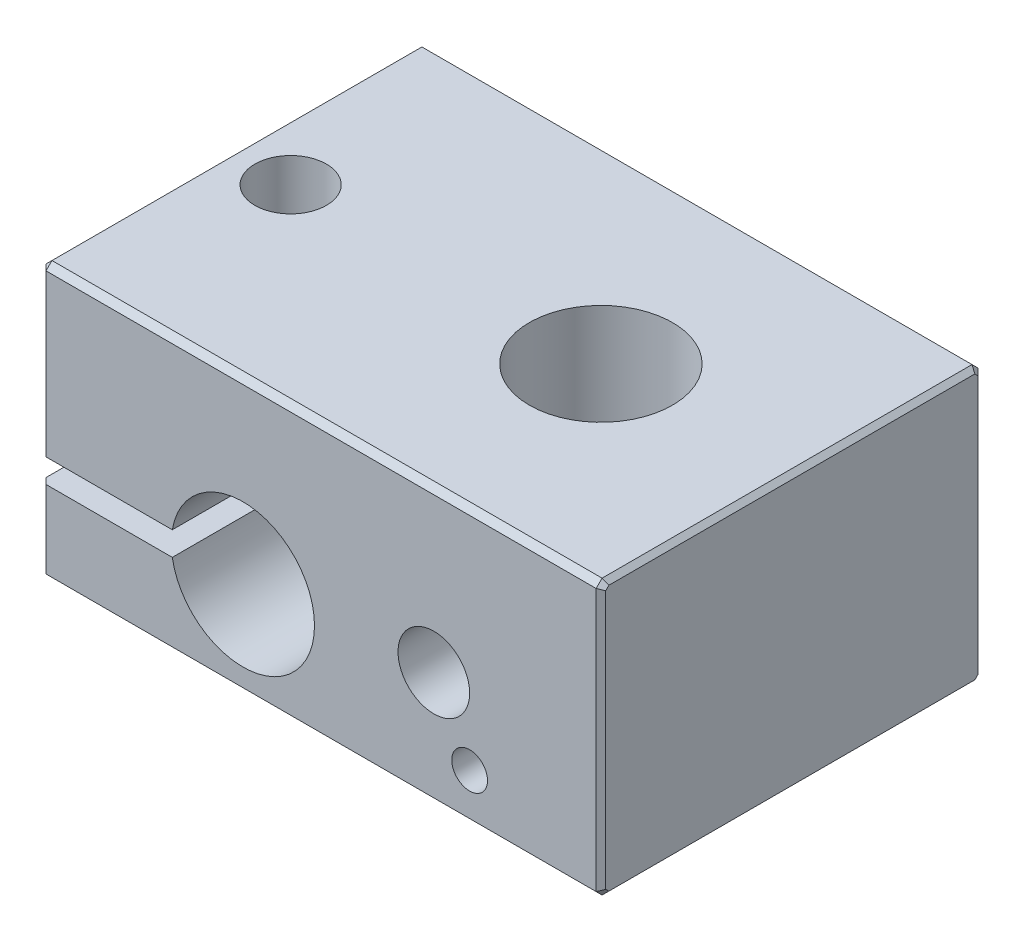
ISO-10303-21;
HEADER;
FILE_DESCRIPTION(('STEP AP214'),'2;1');
FILE_NAME('part.step','',(''),(''),'','','');
FILE_SCHEMA(('AUTOMOTIVE_DESIGN { 1 0 10303 214 1 1 1 1 }'));
ENDSEC;
DATA;
#1=APPLICATION_CONTEXT('core data for automotive mechanical design processes');
#2=APPLICATION_PROTOCOL_DEFINITION('international standard','automotive_design',2000,#1);
#3=PRODUCT_CONTEXT('',#1,'mechanical');
#4=PRODUCT('Part','Part','',(#3));
#5=PRODUCT_RELATED_PRODUCT_CATEGORY('part','',(#4));
#6=PRODUCT_DEFINITION_FORMATION('','',#4);
#7=PRODUCT_DEFINITION_CONTEXT('part definition',#1,'design');
#8=PRODUCT_DEFINITION('design','',#6,#7);
#9=PRODUCT_DEFINITION_SHAPE('','',#8);
#10=(LENGTH_UNIT() NAMED_UNIT(*) SI_UNIT(.MILLI.,.METRE.));
#11=(NAMED_UNIT(*) PLANE_ANGLE_UNIT() SI_UNIT($,.RADIAN.));
#12=(NAMED_UNIT(*) SI_UNIT($,.STERADIAN.) SOLID_ANGLE_UNIT());
#13=UNCERTAINTY_MEASURE_WITH_UNIT(LENGTH_MEASURE(1.E-05),#10,'distance_accuracy_value','');
#14=(GEOMETRIC_REPRESENTATION_CONTEXT(3) GLOBAL_UNCERTAINTY_ASSIGNED_CONTEXT((#13)) GLOBAL_UNIT_ASSIGNED_CONTEXT((#10,
#11,#12)) REPRESENTATION_CONTEXT('',''));
#15=CARTESIAN_POINT('',(0.,0.,0.));
#16=DIRECTION('',(0.,0.,1.));
#17=DIRECTION('',(1.,0.,0.));
#18=AXIS2_PLACEMENT_3D('',#15,#16,#17);
#19=CARTESIAN_POINT('',(8.00000000000001,2.,3.49999999999999));
#20=DIRECTION('',(0.,0.,1.));
#21=DIRECTION('',(1.,0.,0.));
#22=AXIS2_PLACEMENT_3D('',#19,#20,#21);
#23=PLANE('',#22);
#24=CARTESIAN_POINT('',(8.00000000000001,2.,3.49999999999999));
#25=DIRECTION('',(0.,0.,1.));
#26=DIRECTION('',(1.,0.,0.));
#27=AXIS2_PLACEMENT_3D('',#24,#25,#26);
#28=CIRCLE('',#27,0.750000000000001);
#29=CARTESIAN_POINT('',(8.75000000000001,2.,3.49999999999999));
#30=VERTEX_POINT('',#29);
#31=EDGE_CURVE('E395',#30,#30,#28,.T.);
#32=ORIENTED_EDGE('',*,*,#31,.T.);
#33=EDGE_LOOP('',(#32));
#34=FACE_BOUND('',#33,.T.);
#35=ADVANCED_FACE('F34',(#34),#23,.T.);
#36=CARTESIAN_POINT('',(6.50000000000001,4.8,4.49999999999999));
#37=DIRECTION('',(0.,0.,1.));
#38=DIRECTION('',(1.,0.,0.));
#39=AXIS2_PLACEMENT_3D('',#36,#37,#38);
#40=PLANE('',#39);
#41=CARTESIAN_POINT('',(6.50000000000001,4.8,4.49999999999999));
#42=DIRECTION('',(0.,0.,1.));
#43=DIRECTION('',(1.,0.,0.));
#44=AXIS2_PLACEMENT_3D('',#41,#42,#43);
#45=CIRCLE('',#44,1.5);
#46=CARTESIAN_POINT('',(8.00000000000001,4.8,4.49999999999999));
#47=VERTEX_POINT('',#46);
#48=EDGE_CURVE('E267',#47,#47,#45,.T.);
#49=ORIENTED_EDGE('',*,*,#48,.T.);
#50=EDGE_LOOP('',(#49));
#51=FACE_BOUND('',#50,.T.);
#52=ADVANCED_FACE('F637',(#51),#40,.T.);
#53=CARTESIAN_POINT('',(-10.,11.5,-8.00000000000001));
#54=DIRECTION('',(1.,0.,0.));
#55=DIRECTION('',(0.,0.,-1.));
#56=AXIS2_PLACEMENT_3D('',#53,#54,#55);
#57=PLANE('',#56);
#58=DIRECTION('',(0.,1.,0.));
#59=VECTOR('',#58,1.);
#60=CARTESIAN_POINT('',(-9.99999999999999,11.5,7.74999999999999));
#61=LINE('',#60,#59);
#62=CARTESIAN_POINT('',(-9.99999999999999,0.249999999999997,7.74999999999999));
#63=VERTEX_POINT('',#62);
#64=CARTESIAN_POINT('',(-9.99999999999999,3.5,7.74999999999999));
#65=VERTEX_POINT('',#64);
#66=EDGE_CURVE('E393',#63,#65,#61,.T.);
#67=ORIENTED_EDGE('',*,*,#66,.T.);
#68=DIRECTION('',(0.,0.,1.));
#69=VECTOR('',#68,1.);
#70=CARTESIAN_POINT('',(-9.99999999999999,3.5,-8.00000000000001));
#71=LINE('',#70,#69);
#72=CARTESIAN_POINT('',(-9.99999999999999,3.5,-7.75000000000001));
#73=VERTEX_POINT('',#72);
#74=EDGE_CURVE('E373',#65,#73,#71,.F.);
#75=ORIENTED_EDGE('',*,*,#74,.T.);
#76=DIRECTION('',(0.,1.,0.));
#77=VECTOR('',#76,1.);
#78=CARTESIAN_POINT('',(-9.99999999999999,11.5,-7.75000000000001));
#79=LINE('',#78,#77);
#80=CARTESIAN_POINT('',(-9.99999999999999,0.249999999999997,-7.75000000000001));
#81=VERTEX_POINT('',#80);
#82=EDGE_CURVE('E375',#73,#81,#79,.F.);
#83=ORIENTED_EDGE('',*,*,#82,.T.);
#84=DIRECTION('',(0.,0.,1.));
#85=VECTOR('',#84,1.);
#86=CARTESIAN_POINT('',(-10.,0.249999999999997,-8.00000000000001));
#87=LINE('',#86,#85);
#88=EDGE_CURVE('E324',#81,#63,#87,.T.);
#89=ORIENTED_EDGE('',*,*,#88,.T.);
#90=EDGE_LOOP('',(#67,#75,#83,#89));
#91=FACE_BOUND('',#90,.T.);
#92=ADVANCED_FACE('F634',(#91),#57,.F.);
#93=CARTESIAN_POINT('',(-9.75,0.249999999999997,7.99999999999999));
#94=DIRECTION('',(-0.577350269189623,-0.577350269189639,0.577350269189615));
#95=DIRECTION('',(0.707106781186557,-0.707106781186538,0.));
#96=AXIS2_PLACEMENT_3D('',#93,#94,#95);
#97=PLANE('',#96);
#98=DIRECTION('',(-0.707106781186556,0.707106781186539,0.));
#99=VECTOR('',#98,1.);
#100=CARTESIAN_POINT('',(-10.,0.249999999999998,7.74999999999999));
#101=LINE('',#100,#99);
#102=CARTESIAN_POINT('',(-9.74999999999999,0.,7.74999999999999));
#103=VERTEX_POINT('',#102);
#104=EDGE_CURVE('E340',#63,#103,#101,.F.);
#105=ORIENTED_EDGE('',*,*,#104,.T.);
#106=DIRECTION('',(0.,0.707106781186543,0.707106781186552));
#107=VECTOR('',#106,1.);
#108=CARTESIAN_POINT('',(-9.74999999999999,0.249999999999997,7.99999999999999));
#109=LINE('',#108,#107);
#110=CARTESIAN_POINT('',(-9.75,0.249999999999997,7.99999999999999));
#111=VERTEX_POINT('',#110);
#112=EDGE_CURVE('E311',#103,#111,#109,.T.);
#113=ORIENTED_EDGE('',*,*,#112,.T.);
#114=DIRECTION('',(-0.707106781186543,0.,-0.707106781186552));
#115=VECTOR('',#114,1.);
#116=CARTESIAN_POINT('',(-9.75,0.249999999999997,7.99999999999999));
#117=LINE('',#116,#115);
#118=EDGE_CURVE('E396',#111,#63,#117,.T.);
#119=ORIENTED_EDGE('',*,*,#118,.T.);
#120=EDGE_LOOP('',(#105,#113,#119));
#121=FACE_BOUND('',#120,.T.);
#122=ADVANCED_FACE('F631',(#121),#97,.T.);
#123=CARTESIAN_POINT('',(-10.,0.249999999999997,-7.75000000000001));
#124=DIRECTION('',(-0.577350269189615,-0.577350269189639,-0.577350269189623));
#125=DIRECTION('',(0.,0.707106781186537,-0.707106781186557));
#126=AXIS2_PLACEMENT_3D('',#123,#124,#125);
#127=PLANE('',#126);
#128=DIRECTION('',(0.707106781186552,0.,-0.707106781186543));
#129=VECTOR('',#128,1.);
#130=CARTESIAN_POINT('',(-10.,0.249999999999997,-7.75000000000001));
#131=LINE('',#130,#129);
#132=CARTESIAN_POINT('',(-9.75,0.249999999999997,-8.00000000000001));
#133=VERTEX_POINT('',#132);
#134=EDGE_CURVE('E272',#81,#133,#131,.T.);
#135=ORIENTED_EDGE('',*,*,#134,.T.);
#136=DIRECTION('',(0.,-0.707106781186543,0.707106781186552));
#137=VECTOR('',#136,1.);
#138=CARTESIAN_POINT('',(-9.75,0.249999999999997,-8.00000000000001));
#139=LINE('',#138,#137);
#140=CARTESIAN_POINT('',(-9.74999999999999,0.,-7.75000000000001));
#141=VERTEX_POINT('',#140);
#142=EDGE_CURVE('E314',#133,#141,#139,.T.);
#143=ORIENTED_EDGE('',*,*,#142,.T.);
#144=DIRECTION('',(-0.707106781186556,0.707106781186539,0.));
#145=VECTOR('',#144,1.);
#146=CARTESIAN_POINT('',(-10.,0.249999999999997,-7.75000000000001));
#147=LINE('',#146,#145);
#148=EDGE_CURVE('E315',#141,#81,#147,.T.);
#149=ORIENTED_EDGE('',*,*,#148,.T.);
#150=EDGE_LOOP('',(#135,#143,#149));
#151=FACE_BOUND('',#150,.T.);
#152=ADVANCED_FACE('F519',(#151),#127,.T.);
#153=CARTESIAN_POINT('',(-9.75,11.5,7.99999999999999));
#154=DIRECTION('',(0.707106781186552,0.,-0.707106781186543));
#155=DIRECTION('',(-0.707106781186543,0.,-0.707106781186552));
#156=AXIS2_PLACEMENT_3D('',#153,#154,#155);
#157=PLANE('',#156);
#158=ORIENTED_EDGE('',*,*,#66,.F.);
#159=ORIENTED_EDGE('',*,*,#118,.F.);
#160=DIRECTION('',(0.,1.,0.));
#161=VECTOR('',#160,1.);
#162=CARTESIAN_POINT('',(-9.75,11.5,7.99999999999999));
#163=LINE('',#162,#161);
#164=CARTESIAN_POINT('',(-9.75,3.5,7.99999999999999));
#165=VERTEX_POINT('',#164);
#166=EDGE_CURVE('E232',#111,#165,#163,.T.);
#167=ORIENTED_EDGE('',*,*,#166,.T.);
#168=DIRECTION('',(-0.707106781186538,0.,-0.707106781186557));
#169=VECTOR('',#168,1.);
#170=CARTESIAN_POINT('',(-9.75,3.5,7.99999999999999));
#171=LINE('',#170,#169);
#172=EDGE_CURVE('E266',#165,#65,#171,.T.);
#173=ORIENTED_EDGE('',*,*,#172,.T.);
#174=EDGE_LOOP('',(#158,#159,#167,#173));
#175=FACE_BOUND('',#174,.T.);
#176=ADVANCED_FACE('F489',(#175),#157,.F.);
#177=CARTESIAN_POINT('',(8.00000000000001,2.,3.49999999999999));
#178=DIRECTION('',(0.,0.,1.));
#179=DIRECTION('',(1.,0.,0.));
#180=AXIS2_PLACEMENT_3D('',#177,#178,#179);
#181=CYLINDRICAL_SURFACE('',#180,0.750000000000001);
#182=ORIENTED_EDGE('',*,*,#31,.F.);
#183=EDGE_LOOP('',(#182));
#184=FACE_BOUND('',#183,.T.);
#185=CARTESIAN_POINT('',(8.00000000000001,2.,7.99999999999999));
#186=DIRECTION('',(0.,0.,1.));
#187=DIRECTION('',(1.,0.,0.));
#188=AXIS2_PLACEMENT_3D('',#185,#186,#187);
#189=CIRCLE('',#188,0.750000000000001);
#190=CARTESIAN_POINT('',(8.75000000000001,2.,7.99999999999999));
#191=VERTEX_POINT('',#190);
#192=EDGE_CURVE('E231',#191,#191,#189,.T.);
#193=ORIENTED_EDGE('',*,*,#192,.T.);
#194=EDGE_LOOP('',(#193));
#195=FACE_BOUND('',#194,.T.);
#196=ADVANCED_FACE('F622',(#184,#195),#181,.F.);
#197=CARTESIAN_POINT('',(6.50000000000001,4.8,4.49999999999999));
#198=DIRECTION('',(0.,0.,1.));
#199=DIRECTION('',(1.,0.,0.));
#200=AXIS2_PLACEMENT_3D('',#197,#198,#199);
#201=CYLINDRICAL_SURFACE('',#200,1.5);
#202=ORIENTED_EDGE('',*,*,#48,.F.);
#203=EDGE_LOOP('',(#202));
#204=FACE_BOUND('',#203,.T.);
#205=CARTESIAN_POINT('',(6.50000000000001,4.8,7.99999999999999));
#206=DIRECTION('',(0.,0.,1.));
#207=DIRECTION('',(1.,0.,0.));
#208=AXIS2_PLACEMENT_3D('',#205,#206,#207);
#209=CIRCLE('',#208,1.5);
#210=CARTESIAN_POINT('',(8.00000000000001,4.8,7.99999999999999));
#211=VERTEX_POINT('',#210);
#212=EDGE_CURVE('E260',#211,#211,#209,.T.);
#213=ORIENTED_EDGE('',*,*,#212,.T.);
#214=EDGE_LOOP('',(#213));
#215=FACE_BOUND('',#214,.T.);
#216=ADVANCED_FACE('F619',(#204,#215),#201,.F.);
#217=CARTESIAN_POINT('',(-9.99999999999999,3.5,-8.00000000000001));
#218=DIRECTION('',(0.,-1.,0.));
#219=DIRECTION('',(1.,0.,0.));
#220=AXIS2_PLACEMENT_3D('',#217,#218,#219);
#221=PLANE('',#220);
#222=ORIENTED_EDGE('',*,*,#172,.F.);
#223=DIRECTION('',(-1.,0.,0.));
#224=VECTOR('',#223,1.);
#225=CARTESIAN_POINT('',(-9.99999999999999,3.5,7.99999999999999));
#226=LINE('',#225,#224);
#227=CARTESIAN_POINT('',(-4.4580398915498,3.5,7.99999999999999));
#228=VERTEX_POINT('',#227);
#229=EDGE_CURVE('E228',#165,#228,#226,.F.);
#230=ORIENTED_EDGE('',*,*,#229,.T.);
#231=DIRECTION('',(0.,0.,1.));
#232=VECTOR('',#231,1.);
#233=CARTESIAN_POINT('',(-4.4580398915498,3.5,-8.00000000000001));
#234=LINE('',#233,#232);
#235=CARTESIAN_POINT('',(-4.4580398915498,3.5,-8.00000000000001));
#236=VERTEX_POINT('',#235);
#237=EDGE_CURVE('E263',#236,#228,#234,.T.);
#238=ORIENTED_EDGE('',*,*,#237,.F.);
#239=DIRECTION('',(1.,0.,0.));
#240=VECTOR('',#239,1.);
#241=CARTESIAN_POINT('',(-10.,3.5,-8.00000000000001));
#242=LINE('',#241,#240);
#243=CARTESIAN_POINT('',(-9.75,3.5,-8.00000000000001));
#244=VERTEX_POINT('',#243);
#245=EDGE_CURVE('E222',#236,#244,#242,.F.);
#246=ORIENTED_EDGE('',*,*,#245,.T.);
#247=DIRECTION('',(0.707106781186552,0.,-0.707106781186543));
#248=VECTOR('',#247,1.);
#249=CARTESIAN_POINT('',(-10.,3.5,-7.75000000000001));
#250=LINE('',#249,#248);
#251=EDGE_CURVE('E268',#244,#73,#250,.F.);
#252=ORIENTED_EDGE('',*,*,#251,.T.);
#253=ORIENTED_EDGE('',*,*,#74,.F.);
#254=EDGE_LOOP('',(#222,#230,#238,#246,#252,#253));
#255=FACE_BOUND('',#254,.T.);
#256=CARTESIAN_POINT('',(-7.49999999999999,3.5,0.));
#257=DIRECTION('',(0.,1.,0.));
#258=DIRECTION('',(0.,0.,1.));
#259=AXIS2_PLACEMENT_3D('',#256,#257,#258);
#260=CIRCLE('',#259,1.5);
#261=CARTESIAN_POINT('',(-7.49999999999999,3.5,1.49999999999999));
#262=VERTEX_POINT('',#261);
#263=EDGE_CURVE('E386',#262,#262,#260,.F.);
#264=ORIENTED_EDGE('',*,*,#263,.T.);
#265=EDGE_LOOP('',(#264));
#266=FACE_BOUND('',#265,.T.);
#267=ADVANCED_FACE('F494',(#255,#266),#221,.F.);
#268=CARTESIAN_POINT('',(-10.,11.5,-7.75000000000001));
#269=DIRECTION('',(0.707106781186543,0.,0.707106781186552));
#270=DIRECTION('',(0.707106781186552,0.,-0.707106781186543));
#271=AXIS2_PLACEMENT_3D('',#268,#269,#270);
#272=PLANE('',#271);
#273=DIRECTION('',(0.,1.,0.));
#274=VECTOR('',#273,1.);
#275=CARTESIAN_POINT('',(-9.75,11.5,-8.00000000000001));
#276=LINE('',#275,#274);
#277=EDGE_CURVE('E224',#244,#133,#276,.F.);
#278=ORIENTED_EDGE('',*,*,#277,.T.);
#279=ORIENTED_EDGE('',*,*,#134,.F.);
#280=ORIENTED_EDGE('',*,*,#82,.F.);
#281=ORIENTED_EDGE('',*,*,#251,.F.);
#282=EDGE_LOOP('',(#278,#279,#280,#281));
#283=FACE_BOUND('',#282,.T.);
#284=ADVANCED_FACE('F512',(#283),#272,.F.);
#285=CARTESIAN_POINT('',(-10.,11.5,-7.75000000000001));
#286=DIRECTION('',(0.707106781186552,0.,0.707106781186543));
#287=DIRECTION('',(0.707106781186543,0.,-0.707106781186552));
#288=AXIS2_PLACEMENT_3D('',#285,#286,#287);
#289=PLANE('',#288);
#290=DIRECTION('',(0.,1.,0.));
#291=VECTOR('',#290,1.);
#292=CARTESIAN_POINT('',(-10.,11.5,-7.75000000000001));
#293=LINE('',#292,#291);
#294=CARTESIAN_POINT('',(-9.99999999999999,4.5,-7.75000000000001));
#295=VERTEX_POINT('',#294);
#296=CARTESIAN_POINT('',(-10.,11.25,-7.75000000000001));
#297=VERTEX_POINT('',#296);
#298=EDGE_CURVE('E285',#295,#297,#293,.T.);
#299=ORIENTED_EDGE('',*,*,#298,.T.);
#300=DIRECTION('',(-0.707106781186542,0.,0.707106781186552));
#301=VECTOR('',#300,1.);
#302=CARTESIAN_POINT('',(-9.75,11.25,-8.00000000000001));
#303=LINE('',#302,#301);
#304=CARTESIAN_POINT('',(-9.75,11.25,-8.00000000000001));
#305=VERTEX_POINT('',#304);
#306=EDGE_CURVE('E195',#305,#297,#303,.T.);
#307=ORIENTED_EDGE('',*,*,#306,.F.);
#308=DIRECTION('',(0.,1.,0.));
#309=VECTOR('',#308,1.);
#310=CARTESIAN_POINT('',(-9.75,11.5,-8.00000000000001));
#311=LINE('',#310,#309);
#312=CARTESIAN_POINT('',(-9.75,4.5,-8.00000000000001));
#313=VERTEX_POINT('',#312);
#314=EDGE_CURVE('E257',#305,#313,#311,.F.);
#315=ORIENTED_EDGE('',*,*,#314,.T.);
#316=DIRECTION('',(0.707106781186543,0.,-0.707106781186552));
#317=VECTOR('',#316,1.);
#318=CARTESIAN_POINT('',(-10.,4.5,-7.75000000000001));
#319=LINE('',#318,#317);
#320=EDGE_CURVE('E271',#295,#313,#319,.T.);
#321=ORIENTED_EDGE('',*,*,#320,.F.);
#322=EDGE_LOOP('',(#299,#307,#315,#321));
#323=FACE_BOUND('',#322,.T.);
#324=ADVANCED_FACE('F610',(#323),#289,.F.);
#325=CARTESIAN_POINT('',(-9.75,11.5,7.99999999999999));
#326=DIRECTION('',(0.707106781186552,0.,-0.707106781186543));
#327=DIRECTION('',(-0.707106781186543,0.,-0.707106781186552));
#328=AXIS2_PLACEMENT_3D('',#325,#326,#327);
#329=PLANE('',#328);
#330=DIRECTION('',(0.,1.,0.));
#331=VECTOR('',#330,1.);
#332=CARTESIAN_POINT('',(-9.75,11.5,7.99999999999999));
#333=LINE('',#332,#331);
#334=CARTESIAN_POINT('',(-9.75,4.5,7.99999999999999));
#335=VERTEX_POINT('',#334);
#336=CARTESIAN_POINT('',(-9.75,11.25,7.99999999999999));
#337=VERTEX_POINT('',#336);
#338=EDGE_CURVE('E246',#335,#337,#333,.T.);
#339=ORIENTED_EDGE('',*,*,#338,.T.);
#340=DIRECTION('',(-0.707106781186543,0.,-0.707106781186552));
#341=VECTOR('',#340,1.);
#342=CARTESIAN_POINT('',(-9.75,11.25,7.99999999999999));
#343=LINE('',#342,#341);
#344=CARTESIAN_POINT('',(-9.99999999999999,11.25,7.74999999999999));
#345=VERTEX_POINT('',#344);
#346=EDGE_CURVE('E281',#345,#337,#343,.F.);
#347=ORIENTED_EDGE('',*,*,#346,.F.);
#348=DIRECTION('',(0.,1.,0.));
#349=VECTOR('',#348,1.);
#350=CARTESIAN_POINT('',(-9.99999999999999,11.5,7.74999999999999));
#351=LINE('',#350,#349);
#352=CARTESIAN_POINT('',(-9.99999999999999,4.5,7.74999999999999));
#353=VERTEX_POINT('',#352);
#354=EDGE_CURVE('E337',#345,#353,#351,.F.);
#355=ORIENTED_EDGE('',*,*,#354,.T.);
#356=DIRECTION('',(-0.707106781186543,0.,-0.707106781186552));
#357=VECTOR('',#356,1.);
#358=CARTESIAN_POINT('',(-9.75,4.5,7.99999999999999));
#359=LINE('',#358,#357);
#360=EDGE_CURVE('E322',#335,#353,#359,.T.);
#361=ORIENTED_EDGE('',*,*,#360,.F.);
#362=EDGE_LOOP('',(#339,#347,#355,#361));
#363=FACE_BOUND('',#362,.T.);
#364=ADVANCED_FACE('F607',(#363),#329,.F.);
#365=CARTESIAN_POINT('',(-10.,0.249999999999997,-8.00000000000001));
#366=DIRECTION('',(0.707106781186539,0.707106781186556,0.));
#367=DIRECTION('',(-0.707106781186556,0.707106781186539,0.));
#368=AXIS2_PLACEMENT_3D('',#365,#366,#367);
#369=PLANE('',#368);
#370=DIRECTION('',(0.,0.,1.));
#371=VECTOR('',#370,1.);
#372=CARTESIAN_POINT('',(-9.74999999999999,0.,0.));
#373=LINE('',#372,#371);
#374=EDGE_CURVE('E334',#141,#103,#373,.T.);
#375=ORIENTED_EDGE('',*,*,#374,.T.);
#376=ORIENTED_EDGE('',*,*,#104,.F.);
#377=ORIENTED_EDGE('',*,*,#88,.F.);
#378=ORIENTED_EDGE('',*,*,#148,.F.);
#379=EDGE_LOOP('',(#375,#376,#377,#378));
#380=FACE_BOUND('',#379,.T.);
#381=ADVANCED_FACE('F523',(#380),#369,.F.);
#382=CARTESIAN_POINT('',(-9.99999999999999,0.249999999999997,7.99999999999999));
#383=DIRECTION('',(0.,0.707106781186552,-0.707106781186543));
#384=DIRECTION('',(0.,0.707106781186543,0.707106781186552));
#385=AXIS2_PLACEMENT_3D('',#382,#383,#384);
#386=PLANE('',#385);
#387=DIRECTION('',(1.,0.,0.));
#388=VECTOR('',#387,1.);
#389=CARTESIAN_POINT('',(0.,0.,7.74999999999999));
#390=LINE('',#389,#388);
#391=CARTESIAN_POINT('',(13.3,0.,7.74999999999999));
#392=VERTEX_POINT('',#391);
#393=EDGE_CURVE('E221',#103,#392,#390,.T.);
#394=ORIENTED_EDGE('',*,*,#393,.T.);
#395=DIRECTION('',(0.,0.707106781186543,0.707106781186552));
#396=VECTOR('',#395,1.);
#397=CARTESIAN_POINT('',(13.3,0.249999999999997,7.99999999999999));
#398=LINE('',#397,#396);
#399=CARTESIAN_POINT('',(13.3,0.249999999999997,7.99999999999999));
#400=VERTEX_POINT('',#399);
#401=EDGE_CURVE('E43',#392,#400,#398,.T.);
#402=ORIENTED_EDGE('',*,*,#401,.T.);
#403=DIRECTION('',(-1.,0.,0.));
#404=VECTOR('',#403,1.);
#405=CARTESIAN_POINT('',(-9.99999999999999,0.249999999999997,7.99999999999999));
#406=LINE('',#405,#404);
#407=EDGE_CURVE('E249',#400,#111,#406,.T.);
#408=ORIENTED_EDGE('',*,*,#407,.T.);
#409=ORIENTED_EDGE('',*,*,#112,.F.);
#410=EDGE_LOOP('',(#394,#402,#408,#409));
#411=FACE_BOUND('',#410,.T.);
#412=ADVANCED_FACE('F527',(#411),#386,.F.);
#413=CARTESIAN_POINT('',(-10.,0.249999999999997,-8.00000000000001));
#414=DIRECTION('',(0.,0.707106781186552,0.707106781186543));
#415=DIRECTION('',(0.,-0.707106781186543,0.707106781186552));
#416=AXIS2_PLACEMENT_3D('',#413,#414,#415);
#417=PLANE('',#416);
#418=DIRECTION('',(1.,0.,0.));
#419=VECTOR('',#418,1.);
#420=CARTESIAN_POINT('',(-10.,0.249999999999997,-8.00000000000001));
#421=LINE('',#420,#419);
#422=CARTESIAN_POINT('',(13.3,0.249999999999997,-8.00000000000001));
#423=VERTEX_POINT('',#422);
#424=EDGE_CURVE('E277',#133,#423,#421,.T.);
#425=ORIENTED_EDGE('',*,*,#424,.T.);
#426=DIRECTION('',(0.,-0.707106781186543,0.707106781186552));
#427=VECTOR('',#426,1.);
#428=CARTESIAN_POINT('',(13.3,0.,-7.75000000000001));
#429=LINE('',#428,#427);
#430=CARTESIAN_POINT('',(13.3,0.,-7.75000000000001));
#431=VERTEX_POINT('',#430);
#432=EDGE_CURVE('E301',#423,#431,#429,.T.);
#433=ORIENTED_EDGE('',*,*,#432,.T.);
#434=DIRECTION('',(1.,0.,0.));
#435=VECTOR('',#434,1.);
#436=CARTESIAN_POINT('',(0.,0.,-7.75000000000001));
#437=LINE('',#436,#435);
#438=EDGE_CURVE('E218',#431,#141,#437,.F.);
#439=ORIENTED_EDGE('',*,*,#438,.T.);
#440=ORIENTED_EDGE('',*,*,#142,.F.);
#441=EDGE_LOOP('',(#425,#433,#439,#440));
#442=FACE_BOUND('',#441,.T.);
#443=ADVANCED_FACE('F515',(#442),#417,.F.);
#444=CARTESIAN_POINT('',(-7.49999999999999,0.,0.));
#445=DIRECTION('',(0.,1.,0.));
#446=DIRECTION('',(0.,0.,1.));
#447=AXIS2_PLACEMENT_3D('',#444,#445,#446);
#448=CYLINDRICAL_SURFACE('',#447,1.5);
#449=CARTESIAN_POINT('',(-7.49999999999999,0.,0.));
#450=DIRECTION('',(0.,1.,0.));
#451=DIRECTION('',(0.,0.,1.));
#452=AXIS2_PLACEMENT_3D('',#449,#450,#451);
#453=CIRCLE('',#452,1.5);
#454=CARTESIAN_POINT('',(-7.49999999999999,0.,1.49999999999999));
#455=VERTEX_POINT('',#454);
#456=EDGE_CURVE('E220',#455,#455,#453,.F.);
#457=ORIENTED_EDGE('',*,*,#456,.T.);
#458=EDGE_LOOP('',(#457));
#459=FACE_BOUND('',#458,.T.);
#460=ORIENTED_EDGE('',*,*,#263,.F.);
#461=EDGE_LOOP('',(#460));
#462=FACE_BOUND('',#461,.T.);
#463=ADVANCED_FACE('F597',(#459,#462),#448,.F.);
#464=CARTESIAN_POINT('',(-1.49999999999999,4.,-8.00000000000001));
#465=DIRECTION('',(0.,0.,1.));
#466=DIRECTION('',(1.,0.,0.));
#467=AXIS2_PLACEMENT_3D('',#464,#465,#466);
#468=CYLINDRICAL_SURFACE('',#467,3.);
#469=DIRECTION('',(0.,0.,1.));
#470=VECTOR('',#469,1.);
#471=CARTESIAN_POINT('',(-4.4580398915498,4.5,-8.00000000000001));
#472=LINE('',#471,#470);
#473=CARTESIAN_POINT('',(-4.4580398915498,4.5,7.99999999999999));
#474=VERTEX_POINT('',#473);
#475=CARTESIAN_POINT('',(-4.4580398915498,4.5,-8.00000000000001));
#476=VERTEX_POINT('',#475);
#477=EDGE_CURVE('E235',#474,#476,#472,.F.);
#478=ORIENTED_EDGE('',*,*,#477,.T.);
#479=CARTESIAN_POINT('',(-1.49999999999999,4.,-8.00000000000001));
#480=DIRECTION('',(0.,0.,1.));
#481=DIRECTION('',(1.,0.,0.));
#482=AXIS2_PLACEMENT_3D('',#479,#480,#481);
#483=CIRCLE('',#482,3.);
#484=EDGE_CURVE('E225',#476,#236,#483,.F.);
#485=ORIENTED_EDGE('',*,*,#484,.T.);
#486=ORIENTED_EDGE('',*,*,#237,.T.);
#487=CARTESIAN_POINT('',(-1.49999999999999,4.,7.99999999999999));
#488=DIRECTION('',(0.,0.,1.));
#489=DIRECTION('',(1.,0.,0.));
#490=AXIS2_PLACEMENT_3D('',#487,#488,#489);
#491=CIRCLE('',#490,3.);
#492=EDGE_CURVE('E250',#228,#474,#491,.T.);
#493=ORIENTED_EDGE('',*,*,#492,.T.);
#494=EDGE_LOOP('',(#478,#485,#486,#493));
#495=FACE_BOUND('',#494,.T.);
#496=ADVANCED_FACE('F502',(#495),#468,.F.);
#497=CARTESIAN_POINT('',(-9.99999999999999,11.5,7.99999999999999));
#498=DIRECTION('',(0.,0.,-1.));
#499=DIRECTION('',(-1.,0.,0.));
#500=AXIS2_PLACEMENT_3D('',#497,#498,#499);
#501=PLANE('',#500);
#502=ORIENTED_EDGE('',*,*,#212,.F.);
#503=EDGE_LOOP('',(#502));
#504=FACE_BOUND('',#503,.T.);
#505=ORIENTED_EDGE('',*,*,#192,.F.);
#506=EDGE_LOOP('',(#505));
#507=FACE_BOUND('',#506,.T.);
#508=ORIENTED_EDGE('',*,*,#407,.F.);
#509=DIRECTION('',(0.,1.,0.));
#510=VECTOR('',#509,1.);
#511=CARTESIAN_POINT('',(13.3,11.25,7.99999999999999));
#512=LINE('',#511,#510);
#513=CARTESIAN_POINT('',(13.3,11.25,7.99999999999999));
#514=VERTEX_POINT('',#513);
#515=EDGE_CURVE('E11',#400,#514,#512,.T.);
#516=ORIENTED_EDGE('',*,*,#515,.T.);
#517=DIRECTION('',(1.,0.,0.));
#518=VECTOR('',#517,1.);
#519=CARTESIAN_POINT('',(0.,11.25,7.99999999999999));
#520=LINE('',#519,#518);
#521=EDGE_CURVE('E204',#337,#514,#520,.T.);
#522=ORIENTED_EDGE('',*,*,#521,.F.);
#523=ORIENTED_EDGE('',*,*,#338,.F.);
#524=DIRECTION('',(-1.,0.,0.));
#525=VECTOR('',#524,1.);
#526=CARTESIAN_POINT('',(-4.4580398915498,4.5,7.99999999999999));
#527=LINE('',#526,#525);
#528=EDGE_CURVE('E239',#335,#474,#527,.F.);
#529=ORIENTED_EDGE('',*,*,#528,.T.);
#530=ORIENTED_EDGE('',*,*,#492,.F.);
#531=ORIENTED_EDGE('',*,*,#229,.F.);
#532=ORIENTED_EDGE('',*,*,#166,.F.);
#533=EDGE_LOOP('',(#508,#516,#522,#523,#529,#530,#531,#532));
#534=FACE_BOUND('',#533,.T.);
#535=ADVANCED_FACE('F497',(#504,#507,#534),#501,.F.);
#536=CARTESIAN_POINT('',(-10.,11.5,-8.00000000000001));
#537=DIRECTION('',(0.,0.,1.));
#538=DIRECTION('',(1.,0.,0.));
#539=AXIS2_PLACEMENT_3D('',#536,#537,#538);
#540=PLANE('',#539);
#541=DIRECTION('',(1.,0.,0.));
#542=VECTOR('',#541,1.);
#543=CARTESIAN_POINT('',(0.,11.25,-8.00000000000001));
#544=LINE('',#543,#542);
#545=CARTESIAN_POINT('',(13.3,11.25,-8.00000000000001));
#546=VERTEX_POINT('',#545);
#547=EDGE_CURVE('E200',#546,#305,#544,.F.);
#548=ORIENTED_EDGE('',*,*,#547,.F.);
#549=DIRECTION('',(0.,-1.,0.));
#550=VECTOR('',#549,1.);
#551=CARTESIAN_POINT('',(13.3,0.249999999999997,-8.00000000000001));
#552=LINE('',#551,#550);
#553=EDGE_CURVE('E299',#546,#423,#552,.T.);
#554=ORIENTED_EDGE('',*,*,#553,.T.);
#555=ORIENTED_EDGE('',*,*,#424,.F.);
#556=ORIENTED_EDGE('',*,*,#277,.F.);
#557=ORIENTED_EDGE('',*,*,#245,.F.);
#558=ORIENTED_EDGE('',*,*,#484,.F.);
#559=DIRECTION('',(-1.,0.,0.));
#560=VECTOR('',#559,1.);
#561=CARTESIAN_POINT('',(-4.4580398915498,4.5,-8.00000000000001));
#562=LINE('',#561,#560);
#563=EDGE_CURVE('E238',#476,#313,#562,.T.);
#564=ORIENTED_EDGE('',*,*,#563,.T.);
#565=ORIENTED_EDGE('',*,*,#314,.F.);
#566=EDGE_LOOP('',(#548,#554,#555,#556,#557,#558,#564,#565));
#567=FACE_BOUND('',#566,.T.);
#568=ADVANCED_FACE('F507',(#567),#540,.F.);
#569=CARTESIAN_POINT('',(-9.75,11.25,-8.00000000000001));
#570=DIRECTION('',(-0.577350269189633,0.57735026918962,-0.577350269189624));
#571=DIRECTION('',(-0.707106781186542,0.,0.707106781186552));
#572=AXIS2_PLACEMENT_3D('',#569,#570,#571);
#573=PLANE('',#572);
#574=ORIENTED_EDGE('',*,*,#306,.T.);
#575=DIRECTION('',(-0.707106781186546,-0.707106781186549,0.));
#576=VECTOR('',#575,1.);
#577=CARTESIAN_POINT('',(-9.75,11.5,-7.75000000000002));
#578=LINE('',#577,#576);
#579=CARTESIAN_POINT('',(-9.75,11.5,-7.75000000000001));
#580=VERTEX_POINT('',#579);
#581=EDGE_CURVE('E190',#580,#297,#578,.T.);
#582=ORIENTED_EDGE('',*,*,#581,.F.);
#583=DIRECTION('',(0.,0.707106781186552,0.707106781186543));
#584=VECTOR('',#583,1.);
#585=CARTESIAN_POINT('',(-9.75,11.5,-7.75000000000001));
#586=LINE('',#585,#584);
#587=EDGE_CURVE('E192',#305,#580,#586,.T.);
#588=ORIENTED_EDGE('',*,*,#587,.F.);
#589=EDGE_LOOP('',(#574,#582,#588));
#590=FACE_BOUND('',#589,.T.);
#591=ADVANCED_FACE('F191',(#590),#573,.T.);
#592=CARTESIAN_POINT('',(-10.,11.5,-8.00000000000001));
#593=DIRECTION('',(1.,0.,0.));
#594=DIRECTION('',(0.,0.,-1.));
#595=AXIS2_PLACEMENT_3D('',#592,#593,#594);
#596=PLANE('',#595);
#597=ORIENTED_EDGE('',*,*,#354,.F.);
#598=DIRECTION('',(0.,0.,1.));
#599=VECTOR('',#598,1.);
#600=CARTESIAN_POINT('',(-10.,11.25,0.));
#601=LINE('',#600,#599);
#602=EDGE_CURVE('E199',#297,#345,#601,.T.);
#603=ORIENTED_EDGE('',*,*,#602,.F.);
#604=ORIENTED_EDGE('',*,*,#298,.F.);
#605=DIRECTION('',(0.,0.,1.));
#606=VECTOR('',#605,1.);
#607=CARTESIAN_POINT('',(-9.99999999999999,4.5,-8.00000000000001));
#608=LINE('',#607,#606);
#609=EDGE_CURVE('E243',#295,#353,#608,.T.);
#610=ORIENTED_EDGE('',*,*,#609,.T.);
#611=EDGE_LOOP('',(#597,#603,#604,#610));
#612=FACE_BOUND('',#611,.T.);
#613=ADVANCED_FACE('F583',(#612),#596,.F.);
#614=CARTESIAN_POINT('',(-9.99999999999999,11.25,7.74999999999999));
#615=DIRECTION('',(-0.577350269189633,0.57735026918962,0.577350269189625));
#616=DIRECTION('',(0.707106781186543,0.,0.707106781186552));
#617=AXIS2_PLACEMENT_3D('',#614,#615,#616);
#618=PLANE('',#617);
#619=ORIENTED_EDGE('',*,*,#346,.T.);
#620=DIRECTION('',(0.,-0.707106781186552,0.707106781186543));
#621=VECTOR('',#620,1.);
#622=CARTESIAN_POINT('',(-9.75,11.5,7.75));
#623=LINE('',#622,#621);
#624=CARTESIAN_POINT('',(-9.75,11.5,7.75));
#625=VERTEX_POINT('',#624);
#626=EDGE_CURVE('E242',#625,#337,#623,.T.);
#627=ORIENTED_EDGE('',*,*,#626,.F.);
#628=DIRECTION('',(-0.707106781186546,-0.707106781186549,0.));
#629=VECTOR('',#628,1.);
#630=CARTESIAN_POINT('',(-9.75,11.5,7.75));
#631=LINE('',#630,#629);
#632=EDGE_CURVE('E209',#345,#625,#631,.F.);
#633=ORIENTED_EDGE('',*,*,#632,.F.);
#634=EDGE_LOOP('',(#619,#627,#633));
#635=FACE_BOUND('',#634,.T.);
#636=ADVANCED_FACE('F579',(#635),#618,.T.);
#637=CARTESIAN_POINT('',(0.,0.,0.));
#638=DIRECTION('',(0.,1.,0.));
#639=DIRECTION('',(0.,0.,1.));
#640=AXIS2_PLACEMENT_3D('',#637,#638,#639);
#641=PLANE('',#640);
#642=ORIENTED_EDGE('',*,*,#456,.F.);
#643=EDGE_LOOP('',(#642));
#644=FACE_BOUND('',#643,.T.);
#645=CARTESIAN_POINT('',(5.50000000000001,0.,0.));
#646=DIRECTION('',(0.,1.,0.));
#647=DIRECTION('',(0.,0.,1.));
#648=AXIS2_PLACEMENT_3D('',#645,#646,#647);
#649=CIRCLE('',#648,3.);
#650=CARTESIAN_POINT('',(5.50000000000001,0.,2.99999999999999));
#651=VERTEX_POINT('',#650);
#652=EDGE_CURVE('E364',#651,#651,#649,.T.);
#653=ORIENTED_EDGE('',*,*,#652,.T.);
#654=EDGE_LOOP('',(#653));
#655=FACE_BOUND('',#654,.T.);
#656=ORIENTED_EDGE('',*,*,#438,.F.);
#657=DIRECTION('',(0.,0.,1.));
#658=VECTOR('',#657,1.);
#659=CARTESIAN_POINT('',(13.3,0.,7.74999999999999));
#660=LINE('',#659,#658);
#661=EDGE_CURVE('E58',#431,#392,#660,.T.);
#662=ORIENTED_EDGE('',*,*,#661,.T.);
#663=ORIENTED_EDGE('',*,*,#393,.F.);
#664=ORIENTED_EDGE('',*,*,#374,.F.);
#665=EDGE_LOOP('',(#656,#662,#663,#664));
#666=FACE_BOUND('',#665,.T.);
#667=ADVANCED_FACE('F525',(#644,#655,#666),#641,.F.);
#668=CARTESIAN_POINT('',(-4.4580398915498,4.5,-8.00000000000001));
#669=DIRECTION('',(0.,1.,0.));
#670=DIRECTION('',(-1.,0.,0.));
#671=AXIS2_PLACEMENT_3D('',#668,#669,#670);
#672=PLANE('',#671);
#673=ORIENTED_EDGE('',*,*,#360,.T.);
#674=ORIENTED_EDGE('',*,*,#609,.F.);
#675=ORIENTED_EDGE('',*,*,#320,.T.);
#676=ORIENTED_EDGE('',*,*,#563,.F.);
#677=ORIENTED_EDGE('',*,*,#477,.F.);
#678=ORIENTED_EDGE('',*,*,#528,.F.);
#679=EDGE_LOOP('',(#673,#674,#675,#676,#677,#678));
#680=FACE_BOUND('',#679,.T.);
#681=CARTESIAN_POINT('',(-7.49999999999999,4.5,0.));
#682=DIRECTION('',(0.,1.,0.));
#683=DIRECTION('',(0.,0.,1.));
#684=AXIS2_PLACEMENT_3D('',#681,#682,#683);
#685=CIRCLE('',#684,1.5);
#686=CARTESIAN_POINT('',(-7.49999999999999,4.5,1.49999999999999));
#687=VERTEX_POINT('',#686);
#688=EDGE_CURVE('E216',#687,#687,#685,.T.);
#689=ORIENTED_EDGE('',*,*,#688,.T.);
#690=EDGE_LOOP('',(#689));
#691=FACE_BOUND('',#690,.T.);
#692=ADVANCED_FACE('F573',(#680,#691),#672,.F.);
#693=CARTESIAN_POINT('',(0.,11.5,7.75));
#694=DIRECTION('',(0.,0.707106781186543,0.707106781186552));
#695=DIRECTION('',(0.,-0.707106781186552,0.707106781186543));
#696=AXIS2_PLACEMENT_3D('',#693,#694,#695);
#697=PLANE('',#696);
#698=ORIENTED_EDGE('',*,*,#521,.T.);
#699=DIRECTION('',(0.,0.707106781186552,-0.707106781186543));
#700=VECTOR('',#699,1.);
#701=CARTESIAN_POINT('',(13.3,11.5,7.74999999999999));
#702=LINE('',#701,#700);
#703=CARTESIAN_POINT('',(13.3,11.5,7.75));
#704=VERTEX_POINT('',#703);
#705=EDGE_CURVE('E435',#514,#704,#702,.T.);
#706=ORIENTED_EDGE('',*,*,#705,.T.);
#707=DIRECTION('',(1.,0.,0.));
#708=VECTOR('',#707,1.);
#709=CARTESIAN_POINT('',(0.,11.5,7.75));
#710=LINE('',#709,#708);
#711=EDGE_CURVE('E184',#625,#704,#710,.T.);
#712=ORIENTED_EDGE('',*,*,#711,.F.);
#713=ORIENTED_EDGE('',*,*,#626,.T.);
#714=EDGE_LOOP('',(#698,#706,#712,#713));
#715=FACE_BOUND('',#714,.T.);
#716=ADVANCED_FACE('F440',(#715),#697,.T.);
#717=CARTESIAN_POINT('',(0.,11.5,-7.75000000000001));
#718=DIRECTION('',(0.,0.707106781186543,-0.707106781186552));
#719=DIRECTION('',(0.,0.707106781186552,0.707106781186543));
#720=AXIS2_PLACEMENT_3D('',#717,#718,#719);
#721=PLANE('',#720);
#722=DIRECTION('',(1.,0.,0.));
#723=VECTOR('',#722,1.);
#724=CARTESIAN_POINT('',(0.,11.5,-7.75000000000001));
#725=LINE('',#724,#723);
#726=CARTESIAN_POINT('',(13.3,11.5,-7.75000000000001));
#727=VERTEX_POINT('',#726);
#728=EDGE_CURVE('E173',#727,#580,#725,.F.);
#729=ORIENTED_EDGE('',*,*,#728,.F.);
#730=DIRECTION('',(0.,-0.707106781186552,-0.707106781186543));
#731=VECTOR('',#730,1.);
#732=CARTESIAN_POINT('',(13.3,11.5,-7.75000000000001));
#733=LINE('',#732,#731);
#734=EDGE_CURVE('E297',#727,#546,#733,.T.);
#735=ORIENTED_EDGE('',*,*,#734,.T.);
#736=ORIENTED_EDGE('',*,*,#547,.T.);
#737=ORIENTED_EDGE('',*,*,#587,.T.);
#738=EDGE_LOOP('',(#729,#735,#736,#737));
#739=FACE_BOUND('',#738,.T.);
#740=ADVANCED_FACE('F202',(#739),#721,.T.);
#741=CARTESIAN_POINT('',(-9.75,11.5,0.));
#742=DIRECTION('',(-0.707106781186549,0.707106781186546,0.));
#743=DIRECTION('',(-0.707106781186546,-0.707106781186549,0.));
#744=AXIS2_PLACEMENT_3D('',#741,#742,#743);
#745=PLANE('',#744);
#746=ORIENTED_EDGE('',*,*,#632,.T.);
#747=DIRECTION('',(0.,0.,1.));
#748=VECTOR('',#747,1.);
#749=CARTESIAN_POINT('',(-9.75,11.5,0.));
#750=LINE('',#749,#748);
#751=EDGE_CURVE('E178',#580,#625,#750,.T.);
#752=ORIENTED_EDGE('',*,*,#751,.F.);
#753=ORIENTED_EDGE('',*,*,#581,.T.);
#754=ORIENTED_EDGE('',*,*,#602,.T.);
#755=EDGE_LOOP('',(#746,#752,#753,#754));
#756=FACE_BOUND('',#755,.T.);
#757=ADVANCED_FACE('F207',(#756),#745,.T.);
#758=CARTESIAN_POINT('',(5.50000000000001,0.,0.));
#759=DIRECTION('',(0.,1.,0.));
#760=DIRECTION('',(0.,0.,1.));
#761=AXIS2_PLACEMENT_3D('',#758,#759,#760);
#762=CYLINDRICAL_SURFACE('',#761,3.);
#763=CARTESIAN_POINT('',(5.50000000000001,11.5,0.));
#764=DIRECTION('',(0.,1.,0.));
#765=DIRECTION('',(0.,0.,1.));
#766=AXIS2_PLACEMENT_3D('',#763,#764,#765);
#767=CIRCLE('',#766,3.);
#768=CARTESIAN_POINT('',(5.50000000000001,11.5,2.99999999999999));
#769=VERTEX_POINT('',#768);
#770=EDGE_CURVE('E210',#769,#769,#767,.F.);
#771=ORIENTED_EDGE('',*,*,#770,.F.);
#772=EDGE_LOOP('',(#771));
#773=FACE_BOUND('',#772,.T.);
#774=ORIENTED_EDGE('',*,*,#652,.F.);
#775=EDGE_LOOP('',(#774));
#776=FACE_BOUND('',#775,.T.);
#777=ADVANCED_FACE('F559',(#773,#776),#762,.F.);
#778=CARTESIAN_POINT('',(-7.49999999999999,0.,0.));
#779=DIRECTION('',(0.,1.,0.));
#780=DIRECTION('',(0.,0.,1.));
#781=AXIS2_PLACEMENT_3D('',#778,#779,#780);
#782=CYLINDRICAL_SURFACE('',#781,1.5);
#783=CARTESIAN_POINT('',(-7.49999999999999,11.5,0.));
#784=DIRECTION('',(0.,1.,0.));
#785=DIRECTION('',(0.,0.,1.));
#786=AXIS2_PLACEMENT_3D('',#783,#784,#785);
#787=CIRCLE('',#786,1.5);
#788=CARTESIAN_POINT('',(-7.49999999999999,11.5,1.49999999999999));
#789=VERTEX_POINT('',#788);
#790=EDGE_CURVE('E213',#789,#789,#787,.F.);
#791=ORIENTED_EDGE('',*,*,#790,.F.);
#792=EDGE_LOOP('',(#791));
#793=FACE_BOUND('',#792,.T.);
#794=ORIENTED_EDGE('',*,*,#688,.F.);
#795=EDGE_LOOP('',(#794));
#796=FACE_BOUND('',#795,.T.);
#797=ADVANCED_FACE('F553',(#793,#796),#782,.F.);
#798=CARTESIAN_POINT('',(0.,11.5,0.));
#799=DIRECTION('',(0.,1.,0.));
#800=DIRECTION('',(0.,0.,1.));
#801=AXIS2_PLACEMENT_3D('',#798,#799,#800);
#802=PLANE('',#801);
#803=ORIENTED_EDGE('',*,*,#790,.T.);
#804=EDGE_LOOP('',(#803));
#805=FACE_BOUND('',#804,.T.);
#806=ORIENTED_EDGE('',*,*,#770,.T.);
#807=EDGE_LOOP('',(#806));
#808=FACE_BOUND('',#807,.T.);
#809=ORIENTED_EDGE('',*,*,#711,.T.);
#810=DIRECTION('',(0.,0.,-1.));
#811=VECTOR('',#810,1.);
#812=CARTESIAN_POINT('',(13.3,11.5,0.));
#813=LINE('',#812,#811);
#814=EDGE_CURVE('E180',#704,#727,#813,.T.);
#815=ORIENTED_EDGE('',*,*,#814,.T.);
#816=ORIENTED_EDGE('',*,*,#728,.T.);
#817=ORIENTED_EDGE('',*,*,#751,.T.);
#818=EDGE_LOOP('',(#809,#815,#816,#817));
#819=FACE_BOUND('',#818,.T.);
#820=ADVANCED_FACE('F176',(#805,#808,#819),#802,.T.);
#821=CARTESIAN_POINT('',(13.5,0.,0.));
#822=DIRECTION('',(1.,0.,0.));
#823=DIRECTION('',(0.,0.,-1.));
#824=AXIS2_PLACEMENT_3D('',#821,#822,#823);
#825=PLANE('',#824);
#826=DIRECTION('',(0.,0.,1.));
#827=VECTOR('',#826,1.);
#828=CARTESIAN_POINT('',(13.5,11.3,0.));
#829=LINE('',#828,#827);
#830=CARTESIAN_POINT('',(13.5,11.3,-7.66715728752539));
#831=VERTEX_POINT('',#830);
#832=CARTESIAN_POINT('',(13.5,11.3,7.66715728752537));
#833=VERTEX_POINT('',#832);
#834=EDGE_CURVE('E431',#831,#833,#829,.T.);
#835=ORIENTED_EDGE('',*,*,#834,.T.);
#836=DIRECTION('',(0.,-0.707106781186552,0.707106781186543));
#837=VECTOR('',#836,1.);
#838=CARTESIAN_POINT('',(13.5,9.48357864376261,9.48357864376274));
#839=LINE('',#838,#837);
#840=CARTESIAN_POINT('',(13.5,11.1671572875254,7.79999999999999));
#841=VERTEX_POINT('',#840);
#842=EDGE_CURVE('E433',#833,#841,#839,.T.);
#843=ORIENTED_EDGE('',*,*,#842,.T.);
#844=DIRECTION('',(0.,-1.,0.));
#845=VECTOR('',#844,1.);
#846=CARTESIAN_POINT('',(13.5,0.249999999999997,7.79999999999999));
#847=LINE('',#846,#845);
#848=CARTESIAN_POINT('',(13.5,0.332842712474618,7.79999999999999));
#849=VERTEX_POINT('',#848);
#850=EDGE_CURVE('E400',#841,#849,#847,.T.);
#851=ORIENTED_EDGE('',*,*,#850,.T.);
#852=DIRECTION('',(0.,-0.707106781186543,-0.707106781186552));
#853=VECTOR('',#852,1.);
#854=CARTESIAN_POINT('',(13.5,0.141421356237312,7.60857864376268));
#855=LINE('',#854,#853);
#856=CARTESIAN_POINT('',(13.5,0.200000000000002,7.66715728752537));
#857=VERTEX_POINT('',#856);
#858=EDGE_CURVE('E421',#849,#857,#855,.T.);
#859=ORIENTED_EDGE('',*,*,#858,.T.);
#860=DIRECTION('',(0.,0.,-1.));
#861=VECTOR('',#860,1.);
#862=CARTESIAN_POINT('',(13.5,0.200000000000002,-7.75000000000001));
#863=LINE('',#862,#861);
#864=CARTESIAN_POINT('',(13.5,0.200000000000002,-7.66715728752539));
#865=VERTEX_POINT('',#864);
#866=EDGE_CURVE('E423',#857,#865,#863,.T.);
#867=ORIENTED_EDGE('',*,*,#866,.T.);
#868=DIRECTION('',(0.,0.707106781186543,-0.707106781186552));
#869=VECTOR('',#868,1.);
#870=CARTESIAN_POINT('',(13.5,0.391421356237308,-7.8585786437627));
#871=LINE('',#870,#869);
#872=CARTESIAN_POINT('',(13.5,0.332842712474617,-7.80000000000001));
#873=VERTEX_POINT('',#872);
#874=EDGE_CURVE('E425',#865,#873,#871,.T.);
#875=ORIENTED_EDGE('',*,*,#874,.T.);
#876=DIRECTION('',(0.,1.,0.));
#877=VECTOR('',#876,1.);
#878=CARTESIAN_POINT('',(13.5,11.25,-7.80000000000001));
#879=LINE('',#878,#877);
#880=CARTESIAN_POINT('',(13.5,11.1671572875254,-7.80000000000001));
#881=VERTEX_POINT('',#880);
#882=EDGE_CURVE('E427',#873,#881,#879,.T.);
#883=ORIENTED_EDGE('',*,*,#882,.T.);
#884=DIRECTION('',(0.,0.707106781186552,0.707106781186543));
#885=VECTOR('',#884,1.);
#886=CARTESIAN_POINT('',(13.5,9.48357864376261,-9.48357864376275));
#887=LINE('',#886,#885);
#888=EDGE_CURVE('E429',#881,#831,#887,.T.);
#889=ORIENTED_EDGE('',*,*,#888,.T.);
#890=EDGE_LOOP('',(#835,#843,#851,#859,#867,#875,#883,#889));
#891=FACE_BOUND('',#890,.T.);
#892=ADVANCED_FACE('F534',(#891),#825,.T.);
#893=CARTESIAN_POINT('',(13.5,-3.73357864376269,-3.73357864376264));
#894=DIRECTION('',(0.707106781186542,-0.500000000000007,-0.5));
#895=DIRECTION('',(0.,-0.707106781186543,0.707106781186552));
#896=AXIS2_PLACEMENT_3D('',#893,#894,#895);
#897=PLANE('',#896);
#898=DIRECTION('',(0.67859834454585,0.67859834454585,0.281084637714805));
#899=VECTOR('',#898,1.);
#900=CARTESIAN_POINT('',(14.9624609514748,1.66246095147481,-7.0613861269835));
#901=LINE('',#900,#899);
#902=EDGE_CURVE('E467',#431,#865,#901,.T.);
#903=ORIENTED_EDGE('',*,*,#902,.F.);
#904=ORIENTED_EDGE('',*,*,#432,.F.);
#905=DIRECTION('',(0.678598344545852,0.281084637714823,0.678598344545841));
#906=VECTOR('',#905,1.);
#907=CARTESIAN_POINT('',(14.5969258767712,0.787204287551229,-6.70307412322887));
#908=LINE('',#907,#906);
#909=EDGE_CURVE('E38',#873,#423,#908,.F.);
#910=ORIENTED_EDGE('',*,*,#909,.F.);
#911=ORIENTED_EDGE('',*,*,#874,.F.);
#912=EDGE_LOOP('',(#903,#904,#910,#911));
#913=FACE_BOUND('',#912,.T.);
#914=ADVANCED_FACE('F36',(#913),#897,.T.);
#915=CARTESIAN_POINT('',(13.5,0.,-7.80000000000001));
#916=DIRECTION('',(0.707106781186541,0.,-0.707106781186554));
#917=DIRECTION('',(0.,-1.,0.));
#918=AXIS2_PLACEMENT_3D('',#915,#916,#917);
#919=PLANE('',#918);
#920=ORIENTED_EDGE('',*,*,#909,.T.);
#921=ORIENTED_EDGE('',*,*,#553,.F.);
#922=DIRECTION('',(-0.67859834454585,0.281084637714834,-0.678598344545838));
#923=VECTOR('',#922,1.);
#924=CARTESIAN_POINT('',(15.6300634458819,10.2848561195259,-5.66993655411814));
#925=LINE('',#924,#923);
#926=EDGE_CURVE('E465',#881,#546,#925,.T.);
#927=ORIENTED_EDGE('',*,*,#926,.F.);
#928=ORIENTED_EDGE('',*,*,#882,.F.);
#929=EDGE_LOOP('',(#920,#921,#927,#928));
#930=FACE_BOUND('',#929,.T.);
#931=ADVANCED_FACE('F544',(#930),#919,.T.);
#932=CARTESIAN_POINT('',(13.5,0.200000000000002,0.));
#933=DIRECTION('',(0.707106781186547,-0.707106781186547,0.));
#934=DIRECTION('',(0.,0.,1.));
#935=AXIS2_PLACEMENT_3D('',#932,#933,#934);
#936=PLANE('',#935);
#937=ORIENTED_EDGE('',*,*,#902,.T.);
#938=ORIENTED_EDGE('',*,*,#866,.F.);
#939=DIRECTION('',(0.678598344545846,0.678598344545846,-0.281084637714823));
#940=VECTOR('',#939,1.);
#941=CARTESIAN_POINT('',(12.4389087296526,-0.861091270347376,8.10667568261896));
#942=LINE('',#941,#940);
#943=EDGE_CURVE('E462',#392,#857,#942,.T.);
#944=ORIENTED_EDGE('',*,*,#943,.F.);
#945=ORIENTED_EDGE('',*,*,#661,.F.);
#946=EDGE_LOOP('',(#937,#938,#944,#945));
#947=FACE_BOUND('',#946,.T.);
#948=ADVANCED_FACE('F528',(#947),#936,.T.);
#949=CARTESIAN_POINT('',(13.5,9.48357864376261,-9.48357864376275));
#950=DIRECTION('',(-0.707106781186549,-0.499999999999996,0.500000000000003));
#951=DIRECTION('',(0.,0.707106781186552,0.707106781186543));
#952=AXIS2_PLACEMENT_3D('',#949,#950,#951);
#953=PLANE('',#952);
#954=ORIENTED_EDGE('',*,*,#926,.T.);
#955=ORIENTED_EDGE('',*,*,#734,.F.);
#956=DIRECTION('',(0.678598344545846,-0.678598344545846,0.281084637714826));
#957=VECTOR('',#956,1.);
#958=CARTESIAN_POINT('',(13.9899835541441,10.8100164458559,-7.46419945405914));
#959=LINE('',#958,#957);
#960=EDGE_CURVE('E459',#831,#727,#959,.F.);
#961=ORIENTED_EDGE('',*,*,#960,.F.);
#962=ORIENTED_EDGE('',*,*,#888,.F.);
#963=EDGE_LOOP('',(#954,#955,#961,#962));
#964=FACE_BOUND('',#963,.T.);
#965=ADVANCED_FACE('F542',(#964),#953,.F.);
#966=CARTESIAN_POINT('',(13.5,-3.73357864376269,3.73357864376263));
#967=DIRECTION('',(0.70710678118655,-0.500000000000002,0.499999999999995));
#968=DIRECTION('',(0.,0.707106781186543,0.707106781186552));
#969=AXIS2_PLACEMENT_3D('',#966,#967,#968);
#970=PLANE('',#969);
#971=ORIENTED_EDGE('',*,*,#943,.T.);
#972=ORIENTED_EDGE('',*,*,#858,.F.);
#973=DIRECTION('',(0.678598344545844,0.281084637714822,-0.67859834454585));
#974=VECTOR('',#973,1.);
#975=CARTESIAN_POINT('',(13.4365123928305,0.306545284542399,7.86348760716948));
#976=LINE('',#975,#974);
#977=EDGE_CURVE('E455',#400,#849,#976,.T.);
#978=ORIENTED_EDGE('',*,*,#977,.F.);
#979=ORIENTED_EDGE('',*,*,#401,.F.);
#980=EDGE_LOOP('',(#971,#972,#978,#979));
#981=FACE_BOUND('',#980,.T.);
#982=ADVANCED_FACE('F532',(#981),#970,.T.);
#983=CARTESIAN_POINT('',(13.5,11.3,0.));
#984=DIRECTION('',(-0.707106781186547,-0.707106781186547,0.));
#985=DIRECTION('',(0.,0.,1.));
#986=AXIS2_PLACEMENT_3D('',#983,#984,#985);
#987=PLANE('',#986);
#988=ORIENTED_EDGE('',*,*,#960,.T.);
#989=ORIENTED_EDGE('',*,*,#814,.F.);
#990=DIRECTION('',(0.678598344545847,-0.678598344545847,-0.281084637714821));
#991=VECTOR('',#990,1.);
#992=CARTESIAN_POINT('',(14.9624609514749,9.83753904852512,7.06138612698342));
#993=LINE('',#992,#991);
#994=EDGE_CURVE('E449',#833,#704,#993,.F.);
#995=ORIENTED_EDGE('',*,*,#994,.F.);
#996=ORIENTED_EDGE('',*,*,#834,.F.);
#997=EDGE_LOOP('',(#988,#989,#995,#996));
#998=FACE_BOUND('',#997,.T.);
#999=ADVANCED_FACE('F540',(#998),#987,.F.);
#1000=CARTESIAN_POINT('',(13.5,0.,7.79999999999999));
#1001=DIRECTION('',(0.707106781186551,0.,0.707106781186544));
#1002=DIRECTION('',(0.,1.,0.));
#1003=AXIS2_PLACEMENT_3D('',#1000,#1001,#1002);
#1004=PLANE('',#1003);
#1005=ORIENTED_EDGE('',*,*,#977,.T.);
#1006=ORIENTED_EDGE('',*,*,#850,.F.);
#1007=DIRECTION('',(0.678598344545846,-0.281084637714809,-0.678598344545852));
#1008=VECTOR('',#1007,1.);
#1009=CARTESIAN_POINT('',(15.6300634458817,10.284856119526,5.66993655411827));
#1010=LINE('',#1009,#1008);
#1011=EDGE_CURVE('E446',#514,#841,#1010,.T.);
#1012=ORIENTED_EDGE('',*,*,#1011,.F.);
#1013=ORIENTED_EDGE('',*,*,#515,.F.);
#1014=EDGE_LOOP('',(#1005,#1006,#1012,#1013));
#1015=FACE_BOUND('',#1014,.T.);
#1016=ADVANCED_FACE('F453',(#1015),#1004,.T.);
#1017=CARTESIAN_POINT('',(13.5,9.48357864376261,9.48357864376274));
#1018=DIRECTION('',(-0.707106781186547,-0.499999999999997,-0.500000000000004));
#1019=DIRECTION('',(0.,-0.707106781186552,0.707106781186543));
#1020=AXIS2_PLACEMENT_3D('',#1017,#1018,#1019);
#1021=PLANE('',#1020);
#1022=ORIENTED_EDGE('',*,*,#994,.T.);
#1023=ORIENTED_EDGE('',*,*,#705,.F.);
#1024=ORIENTED_EDGE('',*,*,#1011,.T.);
#1025=ORIENTED_EDGE('',*,*,#842,.F.);
#1026=EDGE_LOOP('',(#1022,#1023,#1024,#1025));
#1027=FACE_BOUND('',#1026,.T.);
#1028=ADVANCED_FACE('F444',(#1027),#1021,.F.);
#1029=CLOSED_SHELL('',(#35,#52,#92,#122,#152,#176,#196,#216,#267,#284,#324,#364,#381,#412,#443,
#463,#496,#535,#568,#591,#613,#636,#667,#692,#716,#740,#757,#777,#797,#820,#892,#914,#931,#948,
#965,#982,#999,#1016,#1028));
#1030=MANIFOLD_SOLID_BREP('B2',#1029);
#1031=ADVANCED_BREP_SHAPE_REPRESENTATION('',(#18,#1030),#14);
#1032=SHAPE_DEFINITION_REPRESENTATION(#9,#1031);
ENDSEC;
END-ISO-10303-21;
